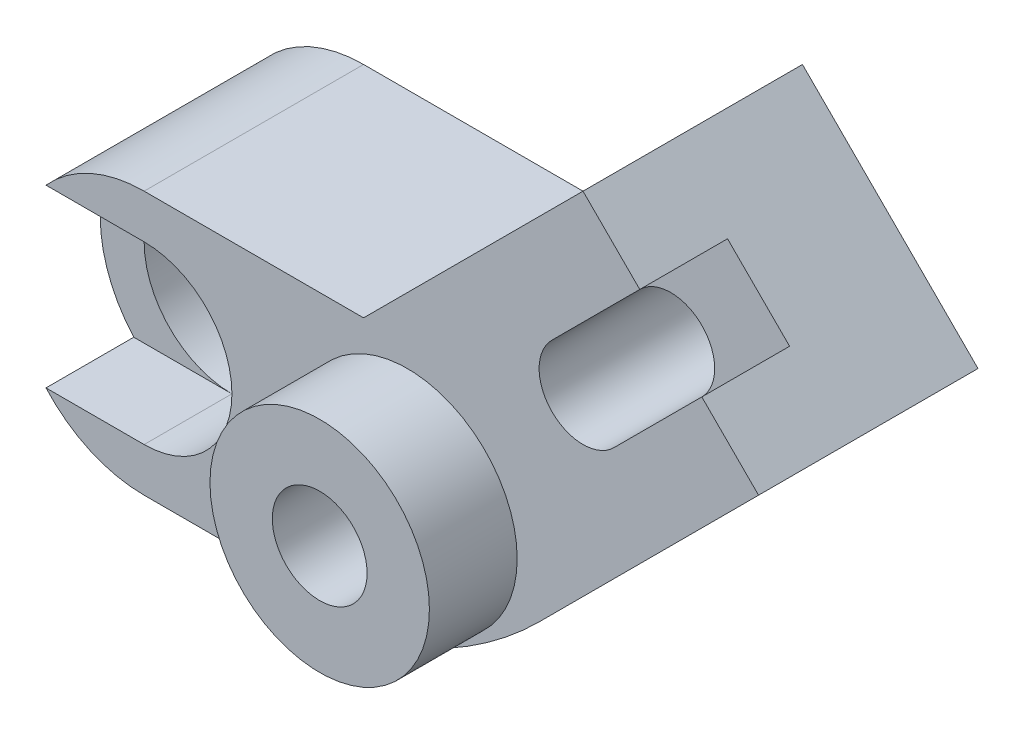
ISO-10303-21;
HEADER;
FILE_DESCRIPTION(('STEP AP214'),'2;1');
FILE_NAME('part.step','',(''),(''),'','','');
FILE_SCHEMA(('AUTOMOTIVE_DESIGN { 1 0 10303 214 1 1 1 1 }'));
ENDSEC;
DATA;
#1=APPLICATION_CONTEXT('core data for automotive mechanical design processes');
#2=APPLICATION_PROTOCOL_DEFINITION('international standard','automotive_design',2000,#1);
#3=PRODUCT_CONTEXT('',#1,'mechanical');
#4=PRODUCT('Part','Part','',(#3));
#5=PRODUCT_RELATED_PRODUCT_CATEGORY('part','',(#4));
#6=PRODUCT_DEFINITION_FORMATION('','',#4);
#7=PRODUCT_DEFINITION_CONTEXT('part definition',#1,'design');
#8=PRODUCT_DEFINITION('design','',#6,#7);
#9=PRODUCT_DEFINITION_SHAPE('','',#8);
#10=(LENGTH_UNIT() NAMED_UNIT(*) SI_UNIT(.MILLI.,.METRE.));
#11=(NAMED_UNIT(*) PLANE_ANGLE_UNIT() SI_UNIT($,.RADIAN.));
#12=(NAMED_UNIT(*) SI_UNIT($,.STERADIAN.) SOLID_ANGLE_UNIT());
#13=UNCERTAINTY_MEASURE_WITH_UNIT(LENGTH_MEASURE(1.E-05),#10,'distance_accuracy_value','');
#14=(GEOMETRIC_REPRESENTATION_CONTEXT(3) GLOBAL_UNCERTAINTY_ASSIGNED_CONTEXT((#13)) GLOBAL_UNIT_ASSIGNED_CONTEXT((#10,
#11,#12)) REPRESENTATION_CONTEXT('',''));
#15=CARTESIAN_POINT('',(0.,0.,0.));
#16=DIRECTION('',(0.,0.,1.));
#17=DIRECTION('',(1.,0.,0.));
#18=AXIS2_PLACEMENT_3D('',#15,#16,#17);
#19=CARTESIAN_POINT('',(-70.,-20.,10.));
#20=DIRECTION('',(0.,0.,1.));
#21=DIRECTION('',(1.,0.,0.));
#22=AXIS2_PLACEMENT_3D('',#19,#20,#21);
#23=CYLINDRICAL_SURFACE('',#22,10.);
#24=CARTESIAN_POINT('',(-70.,-20.,10.));
#25=DIRECTION('',(0.,0.,1.));
#26=DIRECTION('',(1.,0.,0.));
#27=AXIS2_PLACEMENT_3D('',#24,#25,#26);
#28=CIRCLE('',#27,10.);
#29=CARTESIAN_POINT('',(-60.,-20.,10.));
#30=VERTEX_POINT('',#29);
#31=EDGE_CURVE('E190',#30,#30,#28,.T.);
#32=ORIENTED_EDGE('',*,*,#31,.F.);
#33=EDGE_LOOP('',(#32));
#34=FACE_BOUND('',#33,.T.);
#35=DIRECTION('',(0.,0.,1.));
#36=VECTOR('',#35,1.);
#37=CARTESIAN_POINT('',(-70.,-30.,15.));
#38=LINE('',#37,#36);
#39=CARTESIAN_POINT('',(-70.,-30.,15.));
#40=VERTEX_POINT('',#39);
#41=CARTESIAN_POINT('',(-70.,-30.,25.));
#42=VERTEX_POINT('',#41);
#43=EDGE_CURVE('E174',#40,#42,#38,.T.);
#44=ORIENTED_EDGE('',*,*,#43,.T.);
#45=CARTESIAN_POINT('',(-70.,-20.,25.));
#46=DIRECTION('',(0.,0.,1.));
#47=DIRECTION('',(1.,0.,0.));
#48=AXIS2_PLACEMENT_3D('',#45,#46,#47);
#49=CIRCLE('',#48,10.);
#50=CARTESIAN_POINT('',(-70.,-10.,25.));
#51=VERTEX_POINT('',#50);
#52=EDGE_CURVE('E189',#42,#51,#49,.T.);
#53=ORIENTED_EDGE('',*,*,#52,.T.);
#54=DIRECTION('',(0.,0.,1.));
#55=VECTOR('',#54,1.);
#56=CARTESIAN_POINT('',(-70.,-10.,15.));
#57=LINE('',#56,#55);
#58=CARTESIAN_POINT('',(-70.,-10.,15.));
#59=VERTEX_POINT('',#58);
#60=EDGE_CURVE('E171',#59,#51,#57,.T.);
#61=ORIENTED_EDGE('',*,*,#60,.F.);
#62=CARTESIAN_POINT('',(-70.,-20.,15.));
#63=DIRECTION('',(0.,0.,-1.));
#64=DIRECTION('',(-1.,0.,0.));
#65=AXIS2_PLACEMENT_3D('',#62,#63,#64);
#66=CIRCLE('',#65,10.);
#67=EDGE_CURVE('E164',#40,#59,#66,.T.);
#68=ORIENTED_EDGE('',*,*,#67,.F.);
#69=EDGE_LOOP('',(#44,#53,#61,#68));
#70=FACE_BOUND('',#69,.T.);
#71=ADVANCED_FACE('F35',(#34,#70),#23,.F.);
#72=CARTESIAN_POINT('',(-70.,-20.,25.));
#73=DIRECTION('',(0.,0.,1.));
#74=DIRECTION('',(1.,0.,0.));
#75=AXIS2_PLACEMENT_3D('',#72,#73,#74);
#76=PLANE('',#75);
#77=DIRECTION('',(1.,0.,0.));
#78=VECTOR('',#77,1.);
#79=CARTESIAN_POINT('',(-70.,-30.,25.));
#80=LINE('',#79,#78);
#81=CARTESIAN_POINT('',(-81.180339887499,-30.,25.));
#82=VERTEX_POINT('',#81);
#83=EDGE_CURVE('E159',#82,#42,#80,.T.);
#84=ORIENTED_EDGE('',*,*,#83,.F.);
#85=CARTESIAN_POINT('',(-70.,-20.,25.));
#86=DIRECTION('',(0.,0.,1.));
#87=DIRECTION('',(1.,0.,0.));
#88=AXIS2_PLACEMENT_3D('',#85,#86,#87);
#89=CIRCLE('',#88,15.);
#90=CARTESIAN_POINT('',(-70.,-35.,25.));
#91=VERTEX_POINT('',#90);
#92=EDGE_CURVE('E229',#82,#91,#89,.T.);
#93=ORIENTED_EDGE('',*,*,#92,.T.);
#94=DIRECTION('',(1.,0.,0.));
#95=VECTOR('',#94,1.);
#96=CARTESIAN_POINT('',(-70.,-35.,25.));
#97=LINE('',#96,#95);
#98=CARTESIAN_POINT('',(-40.,-35.,25.));
#99=VERTEX_POINT('',#98);
#100=EDGE_CURVE('E234',#91,#99,#97,.T.);
#101=ORIENTED_EDGE('',*,*,#100,.T.);
#102=CARTESIAN_POINT('',(-57.5000000000001,7.5000000000001,25.));
#103=DIRECTION('',(0.,0.,1.));
#104=DIRECTION('',(1.,0.,0.));
#105=AXIS2_PLACEMENT_3D('',#102,#103,#104);
#106=CIRCLE('',#105,45.9619407771257);
#107=CARTESIAN_POINT('',(-25.,-25.,25.));
#108=VERTEX_POINT('',#107);
#109=EDGE_CURVE('E236',#99,#108,#106,.T.);
#110=ORIENTED_EDGE('',*,*,#109,.T.);
#111=DIRECTION('',(0.707106781186547,0.707106781186548,0.));
#112=VECTOR('',#111,1.);
#113=CARTESIAN_POINT('',(0.,0.,25.));
#114=LINE('',#113,#112);
#115=CARTESIAN_POINT('',(0.,0.,25.));
#116=VERTEX_POINT('',#115);
#117=EDGE_CURVE('E238',#108,#116,#114,.T.);
#118=ORIENTED_EDGE('',*,*,#117,.T.);
#119=DIRECTION('',(-0.707106781186548,0.707106781186547,0.));
#120=VECTOR('',#119,1.);
#121=CARTESIAN_POINT('',(-20.,20.,25.));
#122=LINE('',#121,#120);
#123=CARTESIAN_POINT('',(-6.46492111392533,6.46492111392532,25.));
#124=VERTEX_POINT('',#123);
#125=EDGE_CURVE('E241',#116,#124,#122,.T.);
#126=ORIENTED_EDGE('',*,*,#125,.T.);
#127=DIRECTION('',(-0.707106781186547,-0.707106781186548,0.));
#128=VECTOR('',#127,1.);
#129=CARTESIAN_POINT('',(-6.46492111392533,6.46492111392533,25.));
#130=LINE('',#129,#128);
#131=CARTESIAN_POINT('',(-16.4082001369493,-3.47835790909862,25.));
#132=VERTEX_POINT('',#131);
#133=EDGE_CURVE('E199',#124,#132,#130,.T.);
#134=ORIENTED_EDGE('',*,*,#133,.T.);
#135=CARTESIAN_POINT('',(-20.,0.,25.));
#136=DIRECTION('',(0.,0.,1.));
#137=DIRECTION('',(1.,0.,0.));
#138=AXIS2_PLACEMENT_3D('',#135,#136,#137);
#139=CIRCLE('',#138,5.);
#140=CARTESIAN_POINT('',(-23.4783579090986,3.59179986305073,25.));
#141=VERTEX_POINT('',#140);
#142=EDGE_CURVE('E216',#141,#132,#139,.T.);
#143=ORIENTED_EDGE('',*,*,#142,.F.);
#144=DIRECTION('',(-0.707106781186548,-0.707106781186548,0.));
#145=VECTOR('',#144,1.);
#146=CARTESIAN_POINT('',(-13.5350788860747,13.5350788860747,25.));
#147=LINE('',#146,#145);
#148=CARTESIAN_POINT('',(-13.5350788860747,13.5350788860746,25.));
#149=VERTEX_POINT('',#148);
#150=EDGE_CURVE('E205',#149,#141,#147,.T.);
#151=ORIENTED_EDGE('',*,*,#150,.F.);
#152=CARTESIAN_POINT('',(-20.,20.,25.));
#153=VERTEX_POINT('',#152);
#154=EDGE_CURVE('E240',#149,#153,#122,.T.);
#155=ORIENTED_EDGE('',*,*,#154,.T.);
#156=DIRECTION('',(-0.707106781186547,-0.707106781186548,0.));
#157=VECTOR('',#156,1.);
#158=CARTESIAN_POINT('',(-45.,-5.00000000000002,25.));
#159=LINE('',#158,#157);
#160=CARTESIAN_POINT('',(-45.,-5.00000000000002,25.));
#161=VERTEX_POINT('',#160);
#162=EDGE_CURVE('E244',#153,#161,#159,.T.);
#163=ORIENTED_EDGE('',*,*,#162,.T.);
#164=DIRECTION('',(-1.,0.,0.));
#165=VECTOR('',#164,1.);
#166=CARTESIAN_POINT('',(-45.,-5.00000000000002,25.));
#167=LINE('',#166,#165);
#168=CARTESIAN_POINT('',(-70.,-5.00000000000003,25.));
#169=VERTEX_POINT('',#168);
#170=EDGE_CURVE('E226',#161,#169,#167,.T.);
#171=ORIENTED_EDGE('',*,*,#170,.T.);
#172=CARTESIAN_POINT('',(-81.180339887499,-10.,25.));
#173=VERTEX_POINT('',#172);
#174=EDGE_CURVE('E231',#169,#173,#89,.T.);
#175=ORIENTED_EDGE('',*,*,#174,.T.);
#176=DIRECTION('',(-1.,0.,0.));
#177=VECTOR('',#176,1.);
#178=CARTESIAN_POINT('',(-70.,-10.,25.));
#179=LINE('',#178,#177);
#180=EDGE_CURVE('E156',#51,#173,#179,.T.);
#181=ORIENTED_EDGE('',*,*,#180,.F.);
#182=ORIENTED_EDGE('',*,*,#52,.F.);
#183=EDGE_LOOP('',(#84,#93,#101,#110,#118,#126,#134,#143,#151,#155,#163,#171,#175,#181,#182));
#184=FACE_BOUND('',#183,.T.);
#185=CARTESIAN_POINT('',(-40.,-20.,25.));
#186=DIRECTION('',(0.,0.,1.));
#187=DIRECTION('',(1.,0.,0.));
#188=AXIS2_PLACEMENT_3D('',#185,#186,#187);
#189=CIRCLE('',#188,12.5);
#190=CARTESIAN_POINT('',(-27.5,-20.,25.));
#191=VERTEX_POINT('',#190);
#192=EDGE_CURVE('E193',#191,#191,#189,.T.);
#193=ORIENTED_EDGE('',*,*,#192,.F.);
#194=EDGE_LOOP('',(#193));
#195=FACE_BOUND('',#194,.T.);
#196=ADVANCED_FACE('F301',(#184,#195),#76,.T.);
#197=CARTESIAN_POINT('',(-20.,20.,25.));
#198=DIRECTION('',(-0.707106781186547,-0.707106781186548,0.));
#199=DIRECTION('',(0.707106781186548,-0.707106781186547,0.));
#200=AXIS2_PLACEMENT_3D('',#197,#198,#199);
#201=PLANE('',#200);
#202=DIRECTION('',(0.,0.,1.));
#203=VECTOR('',#202,1.);
#204=CARTESIAN_POINT('',(-6.46492111392533,6.46492111392532,15.));
#205=LINE('',#204,#203);
#206=CARTESIAN_POINT('',(-6.46492111392533,6.46492111392532,15.));
#207=VERTEX_POINT('',#206);
#208=EDGE_CURVE('E210',#207,#124,#205,.T.);
#209=ORIENTED_EDGE('',*,*,#208,.T.);
#210=ORIENTED_EDGE('',*,*,#125,.F.);
#211=DIRECTION('',(0.,0.,-1.));
#212=VECTOR('',#211,1.);
#213=CARTESIAN_POINT('',(0.,0.,25.));
#214=LINE('',#213,#212);
#215=CARTESIAN_POINT('',(0.,0.,0.));
#216=VERTEX_POINT('',#215);
#217=EDGE_CURVE('E266',#116,#216,#214,.T.);
#218=ORIENTED_EDGE('',*,*,#217,.T.);
#219=DIRECTION('',(-0.707106781186548,0.707106781186547,0.));
#220=VECTOR('',#219,1.);
#221=CARTESIAN_POINT('',(-20.,20.,0.));
#222=LINE('',#221,#220);
#223=CARTESIAN_POINT('',(-20.,20.,0.));
#224=VERTEX_POINT('',#223);
#225=EDGE_CURVE('E258',#216,#224,#222,.T.);
#226=ORIENTED_EDGE('',*,*,#225,.T.);
#227=DIRECTION('',(0.,0.,-1.));
#228=VECTOR('',#227,1.);
#229=CARTESIAN_POINT('',(-20.,20.,25.));
#230=LINE('',#229,#228);
#231=EDGE_CURVE('E263',#153,#224,#230,.T.);
#232=ORIENTED_EDGE('',*,*,#231,.F.);
#233=ORIENTED_EDGE('',*,*,#154,.F.);
#234=DIRECTION('',(0.,0.,1.));
#235=VECTOR('',#234,1.);
#236=CARTESIAN_POINT('',(-13.5350788860747,13.5350788860746,15.));
#237=LINE('',#236,#235);
#238=CARTESIAN_POINT('',(-13.5350788860747,13.5350788860746,15.));
#239=VERTEX_POINT('',#238);
#240=EDGE_CURVE('E220',#239,#149,#237,.T.);
#241=ORIENTED_EDGE('',*,*,#240,.F.);
#242=DIRECTION('',(-0.707106781186548,0.707106781186548,0.));
#243=VECTOR('',#242,1.);
#244=CARTESIAN_POINT('',(0.,0.,15.));
#245=LINE('',#244,#243);
#246=EDGE_CURVE('E204',#207,#239,#245,.T.);
#247=ORIENTED_EDGE('',*,*,#246,.F.);
#248=EDGE_LOOP('',(#209,#210,#218,#226,#232,#233,#241,#247));
#249=FACE_BOUND('',#248,.T.);
#250=ADVANCED_FACE('F326',(#249),#201,.F.);
#251=CARTESIAN_POINT('',(-20.,0.,-38.));
#252=DIRECTION('',(0.,0.,1.));
#253=DIRECTION('',(1.,0.,0.));
#254=AXIS2_PLACEMENT_3D('',#251,#252,#253);
#255=CYLINDRICAL_SURFACE('',#254,5.);
#256=CARTESIAN_POINT('',(-20.,0.,0.));
#257=DIRECTION('',(0.,0.,1.));
#258=DIRECTION('',(1.,0.,0.));
#259=AXIS2_PLACEMENT_3D('',#256,#257,#258);
#260=CIRCLE('',#259,5.);
#261=CARTESIAN_POINT('',(-15.,0.,0.));
#262=VERTEX_POINT('',#261);
#263=EDGE_CURVE('E39',#262,#262,#260,.T.);
#264=ORIENTED_EDGE('',*,*,#263,.F.);
#265=EDGE_LOOP('',(#264));
#266=FACE_BOUND('',#265,.T.);
#267=DIRECTION('',(0.,0.,1.));
#268=VECTOR('',#267,1.);
#269=CARTESIAN_POINT('',(-16.4082001369493,-3.47835790909862,15.));
#270=LINE('',#269,#268);
#271=CARTESIAN_POINT('',(-16.4082001369493,-3.47835790909862,15.));
#272=VERTEX_POINT('',#271);
#273=EDGE_CURVE('E214',#272,#132,#270,.T.);
#274=ORIENTED_EDGE('',*,*,#273,.F.);
#275=CARTESIAN_POINT('',(-20.,0.,15.));
#276=DIRECTION('',(0.,0.,1.));
#277=DIRECTION('',(1.,0.,0.));
#278=AXIS2_PLACEMENT_3D('',#275,#276,#277);
#279=CIRCLE('',#278,5.);
#280=CARTESIAN_POINT('',(-23.4783579090986,3.59179986305073,15.));
#281=VERTEX_POINT('',#280);
#282=EDGE_CURVE('E208',#281,#272,#279,.F.);
#283=ORIENTED_EDGE('',*,*,#282,.F.);
#284=DIRECTION('',(0.,0.,1.));
#285=VECTOR('',#284,1.);
#286=CARTESIAN_POINT('',(-23.4783579090986,3.59179986305073,15.));
#287=LINE('',#286,#285);
#288=EDGE_CURVE('E217',#281,#141,#287,.T.);
#289=ORIENTED_EDGE('',*,*,#288,.T.);
#290=ORIENTED_EDGE('',*,*,#142,.T.);
#291=EDGE_LOOP('',(#274,#283,#289,#290));
#292=FACE_BOUND('',#291,.T.);
#293=ADVANCED_FACE('F336',(#266,#292),#255,.F.);
#294=CARTESIAN_POINT('',(-45.,-5.00000000000002,25.));
#295=DIRECTION('',(0.,-1.,0.));
#296=DIRECTION('',(1.,0.,0.));
#297=AXIS2_PLACEMENT_3D('',#294,#295,#296);
#298=PLANE('',#297);
#299=DIRECTION('',(-1.,0.,0.));
#300=VECTOR('',#299,1.);
#301=CARTESIAN_POINT('',(-45.,-5.00000000000002,0.));
#302=LINE('',#301,#300);
#303=CARTESIAN_POINT('',(-45.,-5.00000000000002,0.));
#304=VERTEX_POINT('',#303);
#305=CARTESIAN_POINT('',(-70.,-5.00000000000003,0.));
#306=VERTEX_POINT('',#305);
#307=EDGE_CURVE('E247',#304,#306,#302,.T.);
#308=ORIENTED_EDGE('',*,*,#307,.T.);
#309=DIRECTION('',(0.,0.,-1.));
#310=VECTOR('',#309,1.);
#311=CARTESIAN_POINT('',(-70.,-5.00000000000003,25.));
#312=LINE('',#311,#310);
#313=EDGE_CURVE('E11',#169,#306,#312,.T.);
#314=ORIENTED_EDGE('',*,*,#313,.F.);
#315=ORIENTED_EDGE('',*,*,#170,.F.);
#316=DIRECTION('',(0.,0.,-1.));
#317=VECTOR('',#316,1.);
#318=CARTESIAN_POINT('',(-45.,-5.00000000000002,25.));
#319=LINE('',#318,#317);
#320=EDGE_CURVE('E246',#161,#304,#319,.T.);
#321=ORIENTED_EDGE('',*,*,#320,.T.);
#322=EDGE_LOOP('',(#308,#314,#315,#321));
#323=FACE_BOUND('',#322,.T.);
#324=ADVANCED_FACE('F37',(#323),#298,.F.);
#325=CARTESIAN_POINT('',(-70.,-20.,25.));
#326=DIRECTION('',(0.,0.,-1.));
#327=DIRECTION('',(-1.,0.,0.));
#328=AXIS2_PLACEMENT_3D('',#325,#326,#327);
#329=CYLINDRICAL_SURFACE('',#328,15.);
#330=ORIENTED_EDGE('',*,*,#92,.F.);
#331=DIRECTION('',(0.,0.,1.));
#332=VECTOR('',#331,1.);
#333=CARTESIAN_POINT('',(-81.180339887499,-30.,15.));
#334=LINE('',#333,#332);
#335=CARTESIAN_POINT('',(-81.180339887499,-30.,15.));
#336=VERTEX_POINT('',#335);
#337=EDGE_CURVE('E178',#336,#82,#334,.T.);
#338=ORIENTED_EDGE('',*,*,#337,.F.);
#339=CARTESIAN_POINT('',(-70.,-20.,15.));
#340=DIRECTION('',(0.,0.,1.));
#341=DIRECTION('',(-1.,0.,0.));
#342=AXIS2_PLACEMENT_3D('',#339,#340,#341);
#343=CIRCLE('',#342,15.);
#344=CARTESIAN_POINT('',(-81.180339887499,-10.,15.));
#345=VERTEX_POINT('',#344);
#346=EDGE_CURVE('E169',#345,#336,#343,.T.);
#347=ORIENTED_EDGE('',*,*,#346,.F.);
#348=DIRECTION('',(0.,0.,1.));
#349=VECTOR('',#348,1.);
#350=CARTESIAN_POINT('',(-81.180339887499,-10.,15.));
#351=LINE('',#350,#349);
#352=EDGE_CURVE('E180',#345,#173,#351,.T.);
#353=ORIENTED_EDGE('',*,*,#352,.T.);
#354=ORIENTED_EDGE('',*,*,#174,.F.);
#355=ORIENTED_EDGE('',*,*,#313,.T.);
#356=CARTESIAN_POINT('',(-70.,-20.,0.));
#357=DIRECTION('',(0.,0.,1.));
#358=DIRECTION('',(1.,0.,0.));
#359=AXIS2_PLACEMENT_3D('',#356,#357,#358);
#360=CIRCLE('',#359,15.);
#361=CARTESIAN_POINT('',(-70.,-35.,0.));
#362=VERTEX_POINT('',#361);
#363=EDGE_CURVE('E250',#306,#362,#360,.T.);
#364=ORIENTED_EDGE('',*,*,#363,.T.);
#365=DIRECTION('',(0.,0.,-1.));
#366=VECTOR('',#365,1.);
#367=CARTESIAN_POINT('',(-70.,-35.,25.));
#368=LINE('',#367,#366);
#369=EDGE_CURVE('E44',#91,#362,#368,.T.);
#370=ORIENTED_EDGE('',*,*,#369,.F.);
#371=EDGE_LOOP('',(#330,#338,#347,#353,#354,#355,#364,#370));
#372=FACE_BOUND('',#371,.T.);
#373=ADVANCED_FACE('F305',(#372),#329,.T.);
#374=CARTESIAN_POINT('',(-70.,-35.,25.));
#375=DIRECTION('',(0.,1.,0.));
#376=DIRECTION('',(0.,0.,1.));
#377=AXIS2_PLACEMENT_3D('',#374,#375,#376);
#378=PLANE('',#377);
#379=DIRECTION('',(1.,0.,0.));
#380=VECTOR('',#379,1.);
#381=CARTESIAN_POINT('',(-70.,-35.,0.));
#382=LINE('',#381,#380);
#383=CARTESIAN_POINT('',(-40.,-35.,0.));
#384=VERTEX_POINT('',#383);
#385=EDGE_CURVE('E252',#362,#384,#382,.T.);
#386=ORIENTED_EDGE('',*,*,#385,.T.);
#387=DIRECTION('',(0.,0.,-1.));
#388=VECTOR('',#387,1.);
#389=CARTESIAN_POINT('',(-40.,-35.,25.));
#390=LINE('',#389,#388);
#391=EDGE_CURVE('E272',#99,#384,#390,.T.);
#392=ORIENTED_EDGE('',*,*,#391,.F.);
#393=ORIENTED_EDGE('',*,*,#100,.F.);
#394=ORIENTED_EDGE('',*,*,#369,.T.);
#395=EDGE_LOOP('',(#386,#392,#393,#394));
#396=FACE_BOUND('',#395,.T.);
#397=ADVANCED_FACE('F280',(#396),#378,.F.);
#398=CARTESIAN_POINT('',(-57.5000000000001,7.5000000000001,25.));
#399=DIRECTION('',(0.,0.,-1.));
#400=DIRECTION('',(-1.,0.,0.));
#401=AXIS2_PLACEMENT_3D('',#398,#399,#400);
#402=CYLINDRICAL_SURFACE('',#401,45.9619407771257);
#403=CARTESIAN_POINT('',(-57.5000000000001,7.5000000000001,0.));
#404=DIRECTION('',(0.,0.,1.));
#405=DIRECTION('',(1.,0.,0.));
#406=AXIS2_PLACEMENT_3D('',#403,#404,#405);
#407=CIRCLE('',#406,45.9619407771257);
#408=CARTESIAN_POINT('',(-25.,-25.,0.));
#409=VERTEX_POINT('',#408);
#410=EDGE_CURVE('E254',#384,#409,#407,.T.);
#411=ORIENTED_EDGE('',*,*,#410,.T.);
#412=DIRECTION('',(0.,0.,-1.));
#413=VECTOR('',#412,1.);
#414=CARTESIAN_POINT('',(-25.,-25.,25.));
#415=LINE('',#414,#413);
#416=EDGE_CURVE('E269',#108,#409,#415,.T.);
#417=ORIENTED_EDGE('',*,*,#416,.F.);
#418=ORIENTED_EDGE('',*,*,#109,.F.);
#419=ORIENTED_EDGE('',*,*,#391,.T.);
#420=EDGE_LOOP('',(#411,#417,#418,#419));
#421=FACE_BOUND('',#420,.T.);
#422=ADVANCED_FACE('F292',(#421),#402,.T.);
#423=CARTESIAN_POINT('',(0.,0.,25.));
#424=DIRECTION('',(-0.707106781186548,0.707106781186547,0.));
#425=DIRECTION('',(-0.707106781186547,-0.707106781186548,0.));
#426=AXIS2_PLACEMENT_3D('',#423,#424,#425);
#427=PLANE('',#426);
#428=DIRECTION('',(0.707106781186547,0.707106781186548,0.));
#429=VECTOR('',#428,1.);
#430=CARTESIAN_POINT('',(0.,0.,0.));
#431=LINE('',#430,#429);
#432=EDGE_CURVE('E256',#409,#216,#431,.T.);
#433=ORIENTED_EDGE('',*,*,#432,.T.);
#434=ORIENTED_EDGE('',*,*,#217,.F.);
#435=ORIENTED_EDGE('',*,*,#117,.F.);
#436=ORIENTED_EDGE('',*,*,#416,.T.);
#437=EDGE_LOOP('',(#433,#434,#435,#436));
#438=FACE_BOUND('',#437,.T.);
#439=ADVANCED_FACE('F296',(#438),#427,.F.);
#440=CARTESIAN_POINT('',(-45.,-5.00000000000002,25.));
#441=DIRECTION('',(0.707106781186548,-0.707106781186547,0.));
#442=DIRECTION('',(0.707106781186547,0.707106781186548,0.));
#443=AXIS2_PLACEMENT_3D('',#440,#441,#442);
#444=PLANE('',#443);
#445=DIRECTION('',(-0.707106781186547,-0.707106781186548,0.));
#446=VECTOR('',#445,1.);
#447=CARTESIAN_POINT('',(-45.,-5.00000000000002,0.));
#448=LINE('',#447,#446);
#449=EDGE_CURVE('E230',#224,#304,#448,.T.);
#450=ORIENTED_EDGE('',*,*,#449,.T.);
#451=ORIENTED_EDGE('',*,*,#320,.F.);
#452=ORIENTED_EDGE('',*,*,#162,.F.);
#453=ORIENTED_EDGE('',*,*,#231,.T.);
#454=EDGE_LOOP('',(#450,#451,#452,#453));
#455=FACE_BOUND('',#454,.T.);
#456=ADVANCED_FACE('F322',(#455),#444,.F.);
#457=CARTESIAN_POINT('',(-70.,-20.,0.));
#458=DIRECTION('',(0.,0.,1.));
#459=DIRECTION('',(1.,0.,0.));
#460=AXIS2_PLACEMENT_3D('',#457,#458,#459);
#461=PLANE('',#460);
#462=CARTESIAN_POINT('',(-70.,-20.,0.));
#463=DIRECTION('',(0.,0.,1.));
#464=DIRECTION('',(1.,0.,0.));
#465=AXIS2_PLACEMENT_3D('',#462,#463,#464);
#466=CIRCLE('',#465,5.);
#467=CARTESIAN_POINT('',(-65.,-20.,0.));
#468=VERTEX_POINT('',#467);
#469=EDGE_CURVE('E186',#468,#468,#466,.T.);
#470=ORIENTED_EDGE('',*,*,#469,.T.);
#471=EDGE_LOOP('',(#470));
#472=FACE_BOUND('',#471,.T.);
#473=ORIENTED_EDGE('',*,*,#263,.T.);
#474=EDGE_LOOP('',(#473));
#475=FACE_BOUND('',#474,.T.);
#476=ORIENTED_EDGE('',*,*,#307,.F.);
#477=ORIENTED_EDGE('',*,*,#449,.F.);
#478=ORIENTED_EDGE('',*,*,#225,.F.);
#479=ORIENTED_EDGE('',*,*,#432,.F.);
#480=ORIENTED_EDGE('',*,*,#410,.F.);
#481=ORIENTED_EDGE('',*,*,#385,.F.);
#482=ORIENTED_EDGE('',*,*,#363,.F.);
#483=EDGE_LOOP('',(#476,#477,#478,#479,#480,#481,#482));
#484=FACE_BOUND('',#483,.T.);
#485=ADVANCED_FACE('F287',(#472,#475,#484),#461,.F.);
#486=CARTESIAN_POINT('',(-6.46492111392533,6.46492111392533,15.));
#487=DIRECTION('',(-0.707106781186548,0.707106781186547,0.));
#488=DIRECTION('',(-0.707106781186547,-0.707106781186548,0.));
#489=AXIS2_PLACEMENT_3D('',#486,#487,#488);
#490=PLANE('',#489);
#491=ORIENTED_EDGE('',*,*,#133,.F.);
#492=ORIENTED_EDGE('',*,*,#208,.F.);
#493=DIRECTION('',(-0.707106781186547,-0.707106781186548,0.));
#494=VECTOR('',#493,1.);
#495=CARTESIAN_POINT('',(-6.46492111392533,6.46492111392533,15.));
#496=LINE('',#495,#494);
#497=EDGE_CURVE('E202',#207,#272,#496,.T.);
#498=ORIENTED_EDGE('',*,*,#497,.T.);
#499=ORIENTED_EDGE('',*,*,#273,.T.);
#500=EDGE_LOOP('',(#491,#492,#498,#499));
#501=FACE_BOUND('',#500,.T.);
#502=ADVANCED_FACE('F331',(#501),#490,.T.);
#503=CARTESIAN_POINT('',(-13.5350788860747,13.5350788860747,15.));
#504=DIRECTION('',(-0.707106781186548,0.707106781186548,0.));
#505=DIRECTION('',(-0.707106781186548,-0.707106781186548,0.));
#506=AXIS2_PLACEMENT_3D('',#503,#504,#505);
#507=PLANE('',#506);
#508=ORIENTED_EDGE('',*,*,#150,.T.);
#509=ORIENTED_EDGE('',*,*,#288,.F.);
#510=DIRECTION('',(-0.707106781186548,-0.707106781186548,0.));
#511=VECTOR('',#510,1.);
#512=CARTESIAN_POINT('',(-13.5350788860747,13.5350788860747,15.));
#513=LINE('',#512,#511);
#514=EDGE_CURVE('E59',#239,#281,#513,.T.);
#515=ORIENTED_EDGE('',*,*,#514,.F.);
#516=ORIENTED_EDGE('',*,*,#240,.T.);
#517=EDGE_LOOP('',(#508,#509,#515,#516));
#518=FACE_BOUND('',#517,.T.);
#519=ADVANCED_FACE('F340',(#518),#507,.F.);
#520=CARTESIAN_POINT('',(0.,0.,15.));
#521=DIRECTION('',(0.,0.,1.));
#522=DIRECTION('',(1.,0.,0.));
#523=AXIS2_PLACEMENT_3D('',#520,#521,#522);
#524=PLANE('',#523);
#525=ORIENTED_EDGE('',*,*,#497,.F.);
#526=ORIENTED_EDGE('',*,*,#246,.T.);
#527=ORIENTED_EDGE('',*,*,#514,.T.);
#528=ORIENTED_EDGE('',*,*,#282,.T.);
#529=EDGE_LOOP('',(#525,#526,#527,#528));
#530=FACE_BOUND('',#529,.T.);
#531=ADVANCED_FACE('F332',(#530),#524,.T.);
#532=CARTESIAN_POINT('',(-40.,-20.,35.));
#533=DIRECTION('',(0.,0.,-1.));
#534=DIRECTION('',(-1.,0.,0.));
#535=AXIS2_PLACEMENT_3D('',#532,#533,#534);
#536=CYLINDRICAL_SURFACE('',#535,12.5);
#537=CARTESIAN_POINT('',(-40.,-20.,35.));
#538=DIRECTION('',(0.,0.,1.));
#539=DIRECTION('',(1.,0.,0.));
#540=AXIS2_PLACEMENT_3D('',#537,#538,#539);
#541=CIRCLE('',#540,12.5);
#542=CARTESIAN_POINT('',(-27.5,-20.,35.));
#543=VERTEX_POINT('',#542);
#544=EDGE_CURVE('E196',#543,#543,#541,.T.);
#545=ORIENTED_EDGE('',*,*,#544,.F.);
#546=EDGE_LOOP('',(#545));
#547=FACE_BOUND('',#546,.T.);
#548=ORIENTED_EDGE('',*,*,#192,.T.);
#549=EDGE_LOOP('',(#548));
#550=FACE_BOUND('',#549,.T.);
#551=ADVANCED_FACE('F347',(#547,#550),#536,.T.);
#552=CARTESIAN_POINT('',(-40.,-20.,35.));
#553=DIRECTION('',(0.,0.,1.));
#554=DIRECTION('',(1.,0.,0.));
#555=AXIS2_PLACEMENT_3D('',#552,#553,#554);
#556=PLANE('',#555);
#557=CARTESIAN_POINT('',(-40.,-20.,35.));
#558=DIRECTION('',(0.,0.,1.));
#559=DIRECTION('',(1.,0.,0.));
#560=AXIS2_PLACEMENT_3D('',#557,#558,#559);
#561=CIRCLE('',#560,5.4);
#562=CARTESIAN_POINT('',(-34.6,-20.,35.));
#563=VERTEX_POINT('',#562);
#564=EDGE_CURVE('E157',#563,#563,#561,.T.);
#565=ORIENTED_EDGE('',*,*,#564,.F.);
#566=EDGE_LOOP('',(#565));
#567=FACE_BOUND('',#566,.T.);
#568=ORIENTED_EDGE('',*,*,#544,.T.);
#569=EDGE_LOOP('',(#568));
#570=FACE_BOUND('',#569,.T.);
#571=ADVANCED_FACE('F362',(#567,#570),#556,.T.);
#572=CARTESIAN_POINT('',(-70.,-20.,10.));
#573=DIRECTION('',(0.,0.,1.));
#574=DIRECTION('',(1.,0.,0.));
#575=AXIS2_PLACEMENT_3D('',#572,#573,#574);
#576=PLANE('',#575);
#577=CARTESIAN_POINT('',(-70.,-20.,10.));
#578=DIRECTION('',(0.,0.,1.));
#579=DIRECTION('',(1.,0.,0.));
#580=AXIS2_PLACEMENT_3D('',#577,#578,#579);
#581=CIRCLE('',#580,5.);
#582=CARTESIAN_POINT('',(-65.,-20.,10.));
#583=VERTEX_POINT('',#582);
#584=EDGE_CURVE('E177',#583,#583,#581,.T.);
#585=ORIENTED_EDGE('',*,*,#584,.F.);
#586=EDGE_LOOP('',(#585));
#587=FACE_BOUND('',#586,.T.);
#588=ORIENTED_EDGE('',*,*,#31,.T.);
#589=EDGE_LOOP('',(#588));
#590=FACE_BOUND('',#589,.T.);
#591=ADVANCED_FACE('F360',(#587,#590),#576,.T.);
#592=CARTESIAN_POINT('',(-70.,-20.,-862.));
#593=DIRECTION('',(0.,0.,1.));
#594=DIRECTION('',(1.,0.,0.));
#595=AXIS2_PLACEMENT_3D('',#592,#593,#594);
#596=CYLINDRICAL_SURFACE('',#595,5.);
#597=ORIENTED_EDGE('',*,*,#584,.T.);
#598=EDGE_LOOP('',(#597));
#599=FACE_BOUND('',#598,.T.);
#600=ORIENTED_EDGE('',*,*,#469,.F.);
#601=EDGE_LOOP('',(#600));
#602=FACE_BOUND('',#601,.T.);
#603=ADVANCED_FACE('F389',(#599,#602),#596,.F.);
#604=CARTESIAN_POINT('',(-70.,-30.,15.));
#605=DIRECTION('',(0.,-1.,0.));
#606=DIRECTION('',(0.,0.,-1.));
#607=AXIS2_PLACEMENT_3D('',#604,#605,#606);
#608=PLANE('',#607);
#609=ORIENTED_EDGE('',*,*,#83,.T.);
#610=ORIENTED_EDGE('',*,*,#43,.F.);
#611=DIRECTION('',(1.,0.,0.));
#612=VECTOR('',#611,1.);
#613=CARTESIAN_POINT('',(-70.,-30.,15.));
#614=LINE('',#613,#612);
#615=EDGE_CURVE('E51',#336,#40,#614,.T.);
#616=ORIENTED_EDGE('',*,*,#615,.F.);
#617=ORIENTED_EDGE('',*,*,#337,.T.);
#618=EDGE_LOOP('',(#609,#610,#616,#617));
#619=FACE_BOUND('',#618,.T.);
#620=ADVANCED_FACE('F308',(#619),#608,.F.);
#621=CARTESIAN_POINT('',(-70.,-10.,15.));
#622=DIRECTION('',(0.,1.,0.));
#623=DIRECTION('',(0.,0.,1.));
#624=AXIS2_PLACEMENT_3D('',#621,#622,#623);
#625=PLANE('',#624);
#626=ORIENTED_EDGE('',*,*,#180,.T.);
#627=ORIENTED_EDGE('',*,*,#352,.F.);
#628=DIRECTION('',(-1.,0.,0.));
#629=VECTOR('',#628,1.);
#630=CARTESIAN_POINT('',(-70.,-10.,15.));
#631=LINE('',#630,#629);
#632=EDGE_CURVE('E166',#59,#345,#631,.T.);
#633=ORIENTED_EDGE('',*,*,#632,.F.);
#634=ORIENTED_EDGE('',*,*,#60,.T.);
#635=EDGE_LOOP('',(#626,#627,#633,#634));
#636=FACE_BOUND('',#635,.T.);
#637=ADVANCED_FACE('F313',(#636),#625,.F.);
#638=CARTESIAN_POINT('',(-70.,-20.,15.));
#639=DIRECTION('',(0.,0.,-1.));
#640=DIRECTION('',(-1.,0.,0.));
#641=AXIS2_PLACEMENT_3D('',#638,#639,#640);
#642=PLANE('',#641);
#643=ORIENTED_EDGE('',*,*,#67,.T.);
#644=ORIENTED_EDGE('',*,*,#632,.T.);
#645=ORIENTED_EDGE('',*,*,#346,.T.);
#646=ORIENTED_EDGE('',*,*,#615,.T.);
#647=EDGE_LOOP('',(#643,#644,#645,#646));
#648=FACE_BOUND('',#647,.T.);
#649=ADVANCED_FACE('F150',(#648),#642,.F.);
#650=CARTESIAN_POINT('',(-40.,-20.,20.));
#651=DIRECTION('',(0.,0.,1.));
#652=DIRECTION('',(1.,0.,0.));
#653=AXIS2_PLACEMENT_3D('',#650,#651,#652);
#654=CONICAL_SURFACE('',#653,5.4,1.02974425867665);
#655=CARTESIAN_POINT('',(-40.,-20.,16.7553526572512));
#656=VERTEX_POINT('',#655);
#657=VERTEX_LOOP('',#656);
#658=FACE_BOUND('',#657,.T.);
#659=CARTESIAN_POINT('',(-40.,-20.,20.));
#660=DIRECTION('',(0.,0.,1.));
#661=DIRECTION('',(1.,0.,0.));
#662=AXIS2_PLACEMENT_3D('',#659,#660,#661);
#663=CIRCLE('',#662,5.4);
#664=CARTESIAN_POINT('',(-34.6,-20.,20.));
#665=VERTEX_POINT('',#664);
#666=EDGE_CURVE('E154',#665,#665,#663,.T.);
#667=ORIENTED_EDGE('',*,*,#666,.T.);
#668=EDGE_LOOP('',(#667));
#669=FACE_BOUND('',#668,.T.);
#670=ADVANCED_FACE('F146',(#658,#669),#654,.F.);
#671=CARTESIAN_POINT('',(-40.,-20.,35.));
#672=DIRECTION('',(0.,0.,1.));
#673=DIRECTION('',(1.,0.,0.));
#674=AXIS2_PLACEMENT_3D('',#671,#672,#673);
#675=CYLINDRICAL_SURFACE('',#674,5.4);
#676=ORIENTED_EDGE('',*,*,#666,.F.);
#677=EDGE_LOOP('',(#676));
#678=FACE_BOUND('',#677,.T.);
#679=ORIENTED_EDGE('',*,*,#564,.T.);
#680=EDGE_LOOP('',(#679));
#681=FACE_BOUND('',#680,.T.);
#682=ADVANCED_FACE('F149',(#678,#681),#675,.F.);
#683=CLOSED_SHELL('',(#71,#196,#250,#293,#324,#373,#397,#422,#439,#456,#485,#502,#519,#531,#551,
#571,#591,#603,#620,#637,#649,#670,#682));
#684=MANIFOLD_SOLID_BREP('B2',#683);
#685=ADVANCED_BREP_SHAPE_REPRESENTATION('',(#18,#684),#14);
#686=SHAPE_DEFINITION_REPRESENTATION(#9,#685);
ENDSEC;
END-ISO-10303-21;
